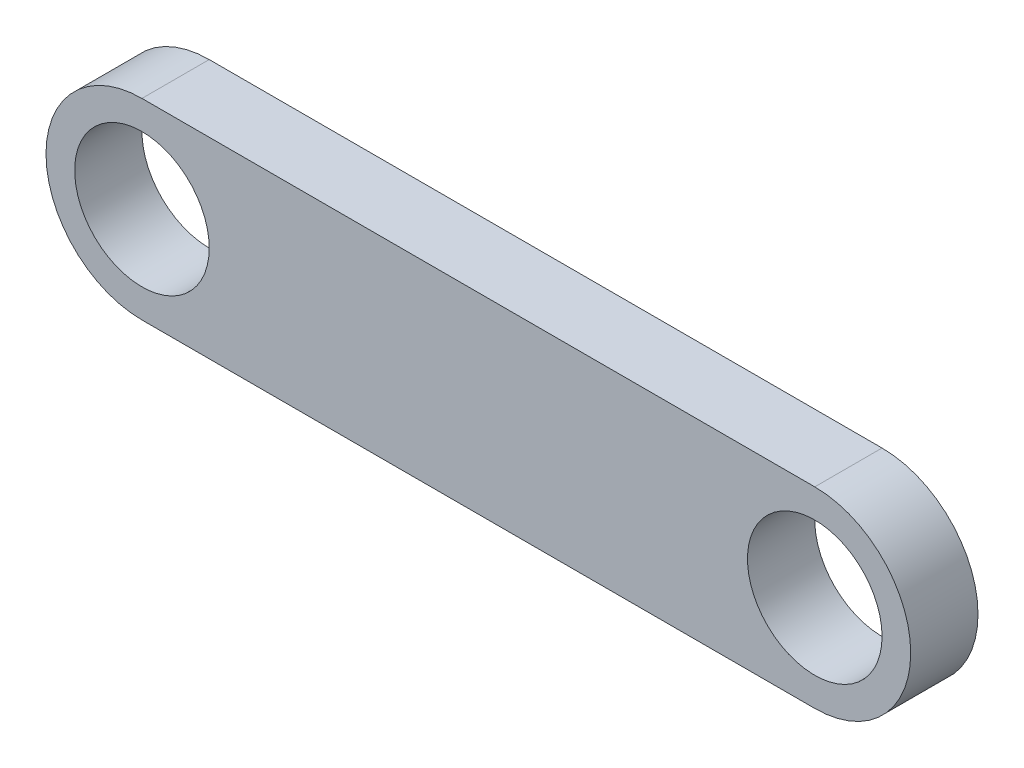
ISO-10303-21;
HEADER;
FILE_DESCRIPTION(('STEP AP214'),'2;1');
FILE_NAME('part.step','',(''),(''),'','','');
FILE_SCHEMA(('AUTOMOTIVE_DESIGN { 1 0 10303 214 1 1 1 1 }'));
ENDSEC;
DATA;
#1=APPLICATION_CONTEXT('core data for automotive mechanical design processes');
#2=APPLICATION_PROTOCOL_DEFINITION('international standard','automotive_design',2000,#1);
#3=PRODUCT_CONTEXT('',#1,'mechanical');
#4=PRODUCT('Part','Part','',(#3));
#5=PRODUCT_RELATED_PRODUCT_CATEGORY('part','',(#4));
#6=PRODUCT_DEFINITION_FORMATION('','',#4);
#7=PRODUCT_DEFINITION_CONTEXT('part definition',#1,'design');
#8=PRODUCT_DEFINITION('design','',#6,#7);
#9=PRODUCT_DEFINITION_SHAPE('','',#8);
#10=(LENGTH_UNIT() NAMED_UNIT(*) SI_UNIT(.MILLI.,.METRE.));
#11=(NAMED_UNIT(*) PLANE_ANGLE_UNIT() SI_UNIT($,.RADIAN.));
#12=(NAMED_UNIT(*) SI_UNIT($,.STERADIAN.) SOLID_ANGLE_UNIT());
#13=UNCERTAINTY_MEASURE_WITH_UNIT(LENGTH_MEASURE(1.E-05),#10,'distance_accuracy_value','');
#14=(GEOMETRIC_REPRESENTATION_CONTEXT(3) GLOBAL_UNCERTAINTY_ASSIGNED_CONTEXT((#13)) GLOBAL_UNIT_ASSIGNED_CONTEXT((#10,
#11,#12)) REPRESENTATION_CONTEXT('',''));
#15=CARTESIAN_POINT('',(0.,0.,0.));
#16=DIRECTION('',(0.,0.,1.));
#17=DIRECTION('',(1.,0.,0.));
#18=AXIS2_PLACEMENT_3D('',#15,#16,#17);
#19=CARTESIAN_POINT('',(0.,0.,5.));
#20=DIRECTION('',(0.,0.,1.));
#21=DIRECTION('',(1.,0.,0.));
#22=AXIS2_PLACEMENT_3D('',#19,#20,#21);
#23=PLANE('',#22);
#24=CARTESIAN_POINT('',(0.,0.,5.));
#25=DIRECTION('',(0.,0.,1.));
#26=DIRECTION('',(1.,0.,0.));
#27=AXIS2_PLACEMENT_3D('',#24,#25,#26);
#28=CIRCLE('',#27,5.);
#29=CARTESIAN_POINT('',(5.,0.,5.));
#30=VERTEX_POINT('',#29);
#31=EDGE_CURVE('E101',#30,#30,#28,.T.);
#32=ORIENTED_EDGE('',*,*,#31,.F.);
#33=EDGE_LOOP('',(#32));
#34=FACE_BOUND('',#33,.T.);
#35=CARTESIAN_POINT('',(0.,0.,5.));
#36=DIRECTION('',(0.,0.,1.));
#37=DIRECTION('',(1.,0.,0.));
#38=AXIS2_PLACEMENT_3D('',#35,#36,#37);
#39=CIRCLE('',#38,7.13028169014085);
#40=CARTESIAN_POINT('',(0.,7.13028169014085,5.));
#41=VERTEX_POINT('',#40);
#42=CARTESIAN_POINT('',(0.,-7.13028169014085,5.));
#43=VERTEX_POINT('',#42);
#44=EDGE_CURVE('E86',#41,#43,#39,.T.);
#45=ORIENTED_EDGE('',*,*,#44,.T.);
#46=DIRECTION('',(1.,0.,0.));
#47=VECTOR('',#46,1.);
#48=CARTESIAN_POINT('',(0.,-7.13028169014085,5.));
#49=LINE('',#48,#47);
#50=CARTESIAN_POINT('',(50.,-7.13028169014085,5.));
#51=VERTEX_POINT('',#50);
#52=EDGE_CURVE('E81',#43,#51,#49,.T.);
#53=ORIENTED_EDGE('',*,*,#52,.T.);
#54=CARTESIAN_POINT('',(50.,0.,5.));
#55=DIRECTION('',(0.,0.,1.));
#56=DIRECTION('',(1.,0.,0.));
#57=AXIS2_PLACEMENT_3D('',#54,#55,#56);
#58=CIRCLE('',#57,7.13028169014085);
#59=CARTESIAN_POINT('',(50.,7.13028169014085,5.));
#60=VERTEX_POINT('',#59);
#61=EDGE_CURVE('E84',#51,#60,#58,.T.);
#62=ORIENTED_EDGE('',*,*,#61,.T.);
#63=DIRECTION('',(-1.,0.,0.));
#64=VECTOR('',#63,1.);
#65=CARTESIAN_POINT('',(0.,7.13028169014085,5.));
#66=LINE('',#65,#64);
#67=EDGE_CURVE('E51',#60,#41,#66,.T.);
#68=ORIENTED_EDGE('',*,*,#67,.T.);
#69=EDGE_LOOP('',(#45,#53,#62,#68));
#70=FACE_BOUND('',#69,.T.);
#71=CARTESIAN_POINT('',(50.,0.,5.));
#72=DIRECTION('',(0.,0.,1.));
#73=DIRECTION('',(1.,0.,0.));
#74=AXIS2_PLACEMENT_3D('',#71,#72,#73);
#75=CIRCLE('',#74,5.);
#76=CARTESIAN_POINT('',(55.,0.,5.));
#77=VERTEX_POINT('',#76);
#78=EDGE_CURVE('E116',#77,#77,#75,.T.);
#79=ORIENTED_EDGE('',*,*,#78,.F.);
#80=EDGE_LOOP('',(#79));
#81=FACE_BOUND('',#80,.T.);
#82=ADVANCED_FACE('F34',(#34,#70,#81),#23,.T.);
#83=CARTESIAN_POINT('',(0.,0.,0.));
#84=DIRECTION('',(0.,0.,1.));
#85=DIRECTION('',(1.,0.,0.));
#86=AXIS2_PLACEMENT_3D('',#83,#84,#85);
#87=PLANE('',#86);
#88=CARTESIAN_POINT('',(0.,0.,0.));
#89=DIRECTION('',(0.,0.,1.));
#90=DIRECTION('',(1.,0.,0.));
#91=AXIS2_PLACEMENT_3D('',#88,#89,#90);
#92=CIRCLE('',#91,7.13028169014085);
#93=CARTESIAN_POINT('',(0.,7.13028169014085,0.));
#94=VERTEX_POINT('',#93);
#95=CARTESIAN_POINT('',(0.,-7.13028169014085,0.));
#96=VERTEX_POINT('',#95);
#97=EDGE_CURVE('E98',#94,#96,#92,.T.);
#98=ORIENTED_EDGE('',*,*,#97,.F.);
#99=DIRECTION('',(-1.,0.,0.));
#100=VECTOR('',#99,1.);
#101=CARTESIAN_POINT('',(0.,7.13028169014085,0.));
#102=LINE('',#101,#100);
#103=CARTESIAN_POINT('',(50.,7.13028169014085,0.));
#104=VERTEX_POINT('',#103);
#105=EDGE_CURVE('E74',#104,#94,#102,.T.);
#106=ORIENTED_EDGE('',*,*,#105,.F.);
#107=CARTESIAN_POINT('',(50.,0.,0.));
#108=DIRECTION('',(0.,0.,1.));
#109=DIRECTION('',(1.,0.,0.));
#110=AXIS2_PLACEMENT_3D('',#107,#108,#109);
#111=CIRCLE('',#110,7.13028169014085);
#112=CARTESIAN_POINT('',(50.,-7.13028169014085,0.));
#113=VERTEX_POINT('',#112);
#114=EDGE_CURVE('E68',#113,#104,#111,.T.);
#115=ORIENTED_EDGE('',*,*,#114,.F.);
#116=DIRECTION('',(1.,0.,0.));
#117=VECTOR('',#116,1.);
#118=CARTESIAN_POINT('',(0.,-7.13028169014085,0.));
#119=LINE('',#118,#117);
#120=EDGE_CURVE('E90',#96,#113,#119,.T.);
#121=ORIENTED_EDGE('',*,*,#120,.F.);
#122=EDGE_LOOP('',(#98,#106,#115,#121));
#123=FACE_BOUND('',#122,.T.);
#124=CARTESIAN_POINT('',(0.,0.,0.));
#125=DIRECTION('',(0.,0.,1.));
#126=DIRECTION('',(1.,0.,0.));
#127=AXIS2_PLACEMENT_3D('',#124,#125,#126);
#128=CIRCLE('',#127,5.);
#129=CARTESIAN_POINT('',(5.,0.,0.));
#130=VERTEX_POINT('',#129);
#131=EDGE_CURVE('E113',#130,#130,#128,.T.);
#132=ORIENTED_EDGE('',*,*,#131,.T.);
#133=EDGE_LOOP('',(#132));
#134=FACE_BOUND('',#133,.T.);
#135=CARTESIAN_POINT('',(50.,0.,0.));
#136=DIRECTION('',(0.,0.,1.));
#137=DIRECTION('',(1.,0.,0.));
#138=AXIS2_PLACEMENT_3D('',#135,#136,#137);
#139=CIRCLE('',#138,5.);
#140=CARTESIAN_POINT('',(55.,0.,0.));
#141=VERTEX_POINT('',#140);
#142=EDGE_CURVE('E119',#141,#141,#139,.T.);
#143=ORIENTED_EDGE('',*,*,#142,.T.);
#144=EDGE_LOOP('',(#143));
#145=FACE_BOUND('',#144,.T.);
#146=ADVANCED_FACE('F109',(#123,#134,#145),#87,.F.);
#147=CARTESIAN_POINT('',(0.,0.,5.));
#148=DIRECTION('',(0.,0.,-1.));
#149=DIRECTION('',(-1.,0.,0.));
#150=AXIS2_PLACEMENT_3D('',#147,#148,#149);
#151=CYLINDRICAL_SURFACE('',#150,7.13028169014085);
#152=ORIENTED_EDGE('',*,*,#97,.T.);
#153=DIRECTION('',(0.,0.,-1.));
#154=VECTOR('',#153,1.);
#155=CARTESIAN_POINT('',(0.,-7.13028169014085,5.));
#156=LINE('',#155,#154);
#157=EDGE_CURVE('E11',#43,#96,#156,.T.);
#158=ORIENTED_EDGE('',*,*,#157,.F.);
#159=ORIENTED_EDGE('',*,*,#44,.F.);
#160=DIRECTION('',(0.,0.,-1.));
#161=VECTOR('',#160,1.);
#162=CARTESIAN_POINT('',(0.,7.13028169014085,5.));
#163=LINE('',#162,#161);
#164=EDGE_CURVE('E94',#41,#94,#163,.T.);
#165=ORIENTED_EDGE('',*,*,#164,.T.);
#166=EDGE_LOOP('',(#152,#158,#159,#165));
#167=FACE_BOUND('',#166,.T.);
#168=ADVANCED_FACE('F36',(#167),#151,.T.);
#169=CARTESIAN_POINT('',(0.,-7.13028169014085,5.));
#170=DIRECTION('',(0.,1.,0.));
#171=DIRECTION('',(0.,0.,1.));
#172=AXIS2_PLACEMENT_3D('',#169,#170,#171);
#173=PLANE('',#172);
#174=ORIENTED_EDGE('',*,*,#120,.T.);
#175=DIRECTION('',(0.,0.,-1.));
#176=VECTOR('',#175,1.);
#177=CARTESIAN_POINT('',(50.,-7.13028169014085,5.));
#178=LINE('',#177,#176);
#179=EDGE_CURVE('E43',#51,#113,#178,.T.);
#180=ORIENTED_EDGE('',*,*,#179,.F.);
#181=ORIENTED_EDGE('',*,*,#52,.F.);
#182=ORIENTED_EDGE('',*,*,#157,.T.);
#183=EDGE_LOOP('',(#174,#180,#181,#182));
#184=FACE_BOUND('',#183,.T.);
#185=ADVANCED_FACE('F89',(#184),#173,.F.);
#186=CARTESIAN_POINT('',(50.,0.,5.));
#187=DIRECTION('',(0.,0.,-1.));
#188=DIRECTION('',(-1.,0.,0.));
#189=AXIS2_PLACEMENT_3D('',#186,#187,#188);
#190=CYLINDRICAL_SURFACE('',#189,7.13028169014085);
#191=ORIENTED_EDGE('',*,*,#114,.T.);
#192=DIRECTION('',(0.,0.,-1.));
#193=VECTOR('',#192,1.);
#194=CARTESIAN_POINT('',(50.,7.13028169014085,5.));
#195=LINE('',#194,#193);
#196=EDGE_CURVE('E91',#60,#104,#195,.T.);
#197=ORIENTED_EDGE('',*,*,#196,.F.);
#198=ORIENTED_EDGE('',*,*,#61,.F.);
#199=ORIENTED_EDGE('',*,*,#179,.T.);
#200=EDGE_LOOP('',(#191,#197,#198,#199));
#201=FACE_BOUND('',#200,.T.);
#202=ADVANCED_FACE('F92',(#201),#190,.T.);
#203=CARTESIAN_POINT('',(0.,7.13028169014085,5.));
#204=DIRECTION('',(0.,-1.,0.));
#205=DIRECTION('',(0.,0.,-1.));
#206=AXIS2_PLACEMENT_3D('',#203,#204,#205);
#207=PLANE('',#206);
#208=ORIENTED_EDGE('',*,*,#105,.T.);
#209=ORIENTED_EDGE('',*,*,#164,.F.);
#210=ORIENTED_EDGE('',*,*,#67,.F.);
#211=ORIENTED_EDGE('',*,*,#196,.T.);
#212=EDGE_LOOP('',(#208,#209,#210,#211));
#213=FACE_BOUND('',#212,.T.);
#214=ADVANCED_FACE('F106',(#213),#207,.F.);
#215=CARTESIAN_POINT('',(0.,0.,5.));
#216=DIRECTION('',(0.,0.,-1.));
#217=DIRECTION('',(-1.,0.,0.));
#218=AXIS2_PLACEMENT_3D('',#215,#216,#217);
#219=CYLINDRICAL_SURFACE('',#218,5.);
#220=ORIENTED_EDGE('',*,*,#31,.T.);
#221=EDGE_LOOP('',(#220));
#222=FACE_BOUND('',#221,.T.);
#223=ORIENTED_EDGE('',*,*,#131,.F.);
#224=EDGE_LOOP('',(#223));
#225=FACE_BOUND('',#224,.T.);
#226=ADVANCED_FACE('F136',(#222,#225),#219,.F.);
#227=CARTESIAN_POINT('',(50.,0.,5.));
#228=DIRECTION('',(0.,0.,-1.));
#229=DIRECTION('',(-1.,0.,0.));
#230=AXIS2_PLACEMENT_3D('',#227,#228,#229);
#231=CYLINDRICAL_SURFACE('',#230,5.);
#232=ORIENTED_EDGE('',*,*,#78,.T.);
#233=EDGE_LOOP('',(#232));
#234=FACE_BOUND('',#233,.T.);
#235=ORIENTED_EDGE('',*,*,#142,.F.);
#236=EDGE_LOOP('',(#235));
#237=FACE_BOUND('',#236,.T.);
#238=ADVANCED_FACE('F125',(#234,#237),#231,.F.);
#239=CLOSED_SHELL('',(#82,#146,#168,#185,#202,#214,#226,#238));
#240=MANIFOLD_SOLID_BREP('B2',#239);
#241=ADVANCED_BREP_SHAPE_REPRESENTATION('',(#18,#240),#14);
#242=SHAPE_DEFINITION_REPRESENTATION(#9,#241);
ENDSEC;
END-ISO-10303-21;
